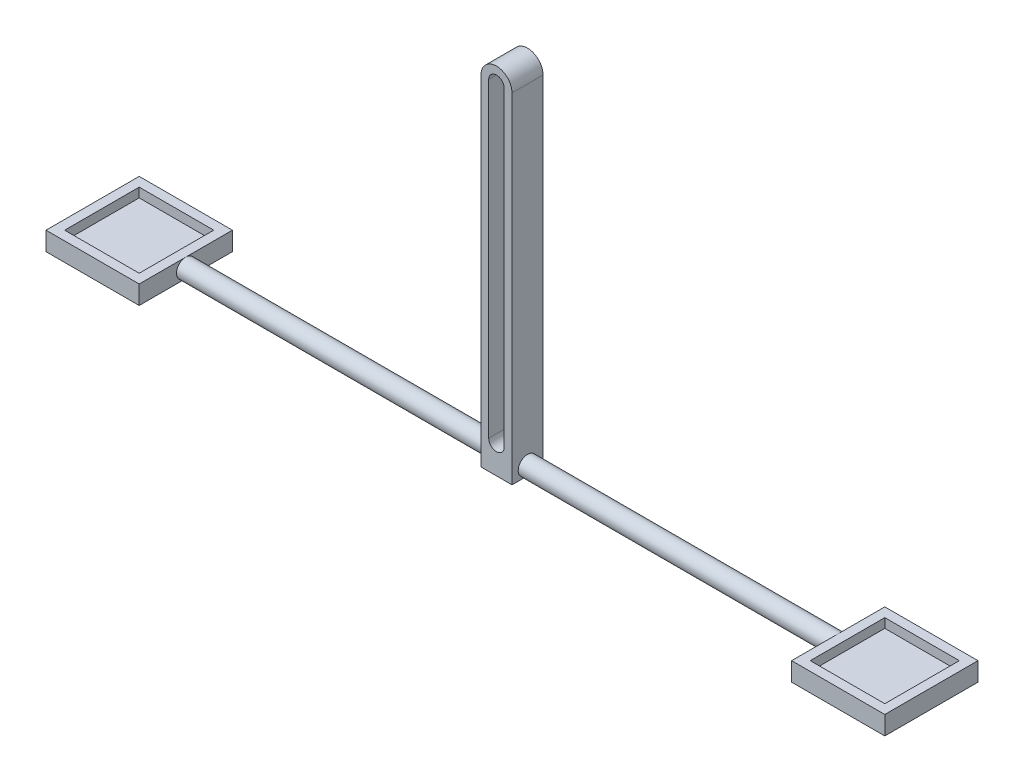
ISO-10303-21;
HEADER;
FILE_DESCRIPTION(('STEP AP214'),'2;1');
FILE_NAME('part.step','',(''),(''),'','','');
FILE_SCHEMA(('AUTOMOTIVE_DESIGN { 1 0 10303 214 1 1 1 1 }'));
ENDSEC;
DATA;
#1=APPLICATION_CONTEXT('core data for automotive mechanical design processes');
#2=APPLICATION_PROTOCOL_DEFINITION('international standard','automotive_design',2000,#1);
#3=PRODUCT_CONTEXT('',#1,'mechanical');
#4=PRODUCT('Part','Part','',(#3));
#5=PRODUCT_RELATED_PRODUCT_CATEGORY('part','',(#4));
#6=PRODUCT_DEFINITION_FORMATION('','',#4);
#7=PRODUCT_DEFINITION_CONTEXT('part definition',#1,'design');
#8=PRODUCT_DEFINITION('design','',#6,#7);
#9=PRODUCT_DEFINITION_SHAPE('','',#8);
#10=(LENGTH_UNIT() NAMED_UNIT(*) SI_UNIT(.MILLI.,.METRE.));
#11=(NAMED_UNIT(*) PLANE_ANGLE_UNIT() SI_UNIT($,.RADIAN.));
#12=(NAMED_UNIT(*) SI_UNIT($,.STERADIAN.) SOLID_ANGLE_UNIT());
#13=UNCERTAINTY_MEASURE_WITH_UNIT(LENGTH_MEASURE(1.E-05),#10,'distance_accuracy_value','');
#14=(GEOMETRIC_REPRESENTATION_CONTEXT(3) GLOBAL_UNCERTAINTY_ASSIGNED_CONTEXT((#13)) GLOBAL_UNIT_ASSIGNED_CONTEXT((#10,
#11,#12)) REPRESENTATION_CONTEXT('',''));
#15=CARTESIAN_POINT('',(0.,0.,0.));
#16=DIRECTION('',(0.,0.,1.));
#17=DIRECTION('',(1.,0.,0.));
#18=AXIS2_PLACEMENT_3D('',#15,#16,#17);
#19=CARTESIAN_POINT('',(0.,100.,10.));
#20=DIRECTION('',(0.,0.,1.));
#21=DIRECTION('',(1.,0.,0.));
#22=AXIS2_PLACEMENT_3D('',#19,#20,#21);
#23=PLANE('',#22);
#24=DIRECTION('',(-1.,0.,0.));
#25=VECTOR('',#24,1.);
#26=CARTESIAN_POINT('',(-4.99999999999997,-9.25,10.));
#27=LINE('',#26,#25);
#28=CARTESIAN_POINT('',(5.,-9.25,10.));
#29=VERTEX_POINT('',#28);
#30=CARTESIAN_POINT('',(-4.99999999999997,-9.25,10.));
#31=VERTEX_POINT('',#30);
#32=EDGE_CURVE('E226',#29,#31,#27,.T.);
#33=ORIENTED_EDGE('',*,*,#32,.F.);
#34=DIRECTION('',(0.,1.,0.));
#35=VECTOR('',#34,1.);
#36=CARTESIAN_POINT('',(5.,-10.,10.));
#37=LINE('',#36,#35);
#38=CARTESIAN_POINT('',(5.,100.,10.));
#39=VERTEX_POINT('',#38);
#40=EDGE_CURVE('E238',#29,#39,#37,.T.);
#41=ORIENTED_EDGE('',*,*,#40,.T.);
#42=CARTESIAN_POINT('',(0.,100.,10.));
#43=DIRECTION('',(0.,0.,1.));
#44=DIRECTION('',(1.,0.,0.));
#45=AXIS2_PLACEMENT_3D('',#42,#43,#44);
#46=CIRCLE('',#45,5.);
#47=CARTESIAN_POINT('',(-5.,100.,10.));
#48=VERTEX_POINT('',#47);
#49=EDGE_CURVE('E251',#39,#48,#46,.T.);
#50=ORIENTED_EDGE('',*,*,#49,.T.);
#51=DIRECTION('',(0.,-1.,0.));
#52=VECTOR('',#51,1.);
#53=CARTESIAN_POINT('',(-5.,100.,10.));
#54=LINE('',#53,#52);
#55=EDGE_CURVE('E240',#48,#31,#54,.T.);
#56=ORIENTED_EDGE('',*,*,#55,.T.);
#57=EDGE_LOOP('',(#33,#41,#50,#56));
#58=FACE_BOUND('',#57,.T.);
#59=DIRECTION('',(0.,1.,0.));
#60=VECTOR('',#59,1.);
#61=CARTESIAN_POINT('',(2.5,0.,10.));
#62=LINE('',#61,#60);
#63=CARTESIAN_POINT('',(2.5,0.,10.));
#64=VERTEX_POINT('',#63);
#65=CARTESIAN_POINT('',(2.5,100.,10.));
#66=VERTEX_POINT('',#65);
#67=EDGE_CURVE('E308',#64,#66,#62,.T.);
#68=ORIENTED_EDGE('',*,*,#67,.F.);
#69=CARTESIAN_POINT('',(0.,0.,10.));
#70=DIRECTION('',(0.,0.,1.));
#71=DIRECTION('',(1.,0.,0.));
#72=AXIS2_PLACEMENT_3D('',#69,#70,#71);
#73=CIRCLE('',#72,2.5);
#74=CARTESIAN_POINT('',(-2.5,0.,10.));
#75=VERTEX_POINT('',#74);
#76=EDGE_CURVE('E288',#75,#64,#73,.T.);
#77=ORIENTED_EDGE('',*,*,#76,.F.);
#78=DIRECTION('',(0.,-1.,0.));
#79=VECTOR('',#78,1.);
#80=CARTESIAN_POINT('',(-2.5,0.,10.));
#81=LINE('',#80,#79);
#82=CARTESIAN_POINT('',(-2.5,100.,10.));
#83=VERTEX_POINT('',#82);
#84=EDGE_CURVE('E283',#83,#75,#81,.T.);
#85=ORIENTED_EDGE('',*,*,#84,.F.);
#86=CARTESIAN_POINT('',(0.,100.,10.));
#87=DIRECTION('',(0.,0.,1.));
#88=DIRECTION('',(1.,0.,0.));
#89=AXIS2_PLACEMENT_3D('',#86,#87,#88);
#90=CIRCLE('',#89,2.5);
#91=EDGE_CURVE('E304',#66,#83,#90,.T.);
#92=ORIENTED_EDGE('',*,*,#91,.F.);
#93=EDGE_LOOP('',(#68,#77,#85,#92));
#94=FACE_BOUND('',#93,.T.);
#95=ADVANCED_FACE('F44',(#58,#94),#23,.T.);
#96=CARTESIAN_POINT('',(0.,100.,0.));
#97=DIRECTION('',(0.,0.,1.));
#98=DIRECTION('',(1.,0.,0.));
#99=AXIS2_PLACEMENT_3D('',#96,#97,#98);
#100=PLANE('',#99);
#101=DIRECTION('',(0.,1.,0.));
#102=VECTOR('',#101,1.);
#103=CARTESIAN_POINT('',(5.,100.,0.));
#104=LINE('',#103,#102);
#105=CARTESIAN_POINT('',(5.00000000000001,-9.25000000000001,0.));
#106=VERTEX_POINT('',#105);
#107=CARTESIAN_POINT('',(5.,100.,0.));
#108=VERTEX_POINT('',#107);
#109=EDGE_CURVE('E264',#106,#108,#104,.T.);
#110=ORIENTED_EDGE('',*,*,#109,.F.);
#111=DIRECTION('',(1.,0.,0.));
#112=VECTOR('',#111,1.);
#113=CARTESIAN_POINT('',(-4.99999999999997,-9.25,0.));
#114=LINE('',#113,#112);
#115=CARTESIAN_POINT('',(-4.99999999999997,-9.25,0.));
#116=VERTEX_POINT('',#115);
#117=EDGE_CURVE('E61',#116,#106,#114,.T.);
#118=ORIENTED_EDGE('',*,*,#117,.F.);
#119=DIRECTION('',(0.,-1.,0.));
#120=VECTOR('',#119,1.);
#121=CARTESIAN_POINT('',(-4.99999999999999,0.,0.));
#122=LINE('',#121,#120);
#123=CARTESIAN_POINT('',(-5.,100.,0.));
#124=VERTEX_POINT('',#123);
#125=EDGE_CURVE('E259',#124,#116,#122,.T.);
#126=ORIENTED_EDGE('',*,*,#125,.F.);
#127=CARTESIAN_POINT('',(0.,100.,0.));
#128=DIRECTION('',(0.,0.,1.));
#129=DIRECTION('',(1.,0.,0.));
#130=AXIS2_PLACEMENT_3D('',#127,#128,#129);
#131=CIRCLE('',#130,5.);
#132=EDGE_CURVE('E255',#108,#124,#131,.T.);
#133=ORIENTED_EDGE('',*,*,#132,.F.);
#134=EDGE_LOOP('',(#110,#118,#126,#133));
#135=FACE_BOUND('',#134,.T.);
#136=CARTESIAN_POINT('',(0.,0.,0.));
#137=DIRECTION('',(0.,0.,1.));
#138=DIRECTION('',(1.,0.,0.));
#139=AXIS2_PLACEMENT_3D('',#136,#137,#138);
#140=CIRCLE('',#139,2.5);
#141=CARTESIAN_POINT('',(-2.5,0.,0.));
#142=VERTEX_POINT('',#141);
#143=CARTESIAN_POINT('',(2.5,0.,0.));
#144=VERTEX_POINT('',#143);
#145=EDGE_CURVE('E297',#142,#144,#140,.T.);
#146=ORIENTED_EDGE('',*,*,#145,.T.);
#147=DIRECTION('',(0.,1.,0.));
#148=VECTOR('',#147,1.);
#149=CARTESIAN_POINT('',(2.5,0.,0.));
#150=LINE('',#149,#148);
#151=CARTESIAN_POINT('',(2.5,100.,0.));
#152=VERTEX_POINT('',#151);
#153=EDGE_CURVE('E293',#144,#152,#150,.T.);
#154=ORIENTED_EDGE('',*,*,#153,.T.);
#155=CARTESIAN_POINT('',(0.,100.,0.));
#156=DIRECTION('',(0.,0.,1.));
#157=DIRECTION('',(1.,0.,0.));
#158=AXIS2_PLACEMENT_3D('',#155,#156,#157);
#159=CIRCLE('',#158,2.5);
#160=CARTESIAN_POINT('',(-2.5,100.,0.));
#161=VERTEX_POINT('',#160);
#162=EDGE_CURVE('E289',#152,#161,#159,.T.);
#163=ORIENTED_EDGE('',*,*,#162,.T.);
#164=DIRECTION('',(0.,-1.,0.));
#165=VECTOR('',#164,1.);
#166=CARTESIAN_POINT('',(-2.5,0.,0.));
#167=LINE('',#166,#165);
#168=EDGE_CURVE('E284',#161,#142,#167,.T.);
#169=ORIENTED_EDGE('',*,*,#168,.T.);
#170=EDGE_LOOP('',(#146,#154,#163,#169));
#171=FACE_BOUND('',#170,.T.);
#172=ADVANCED_FACE('F538',(#135,#171),#100,.F.);
#173=CARTESIAN_POINT('',(0.,100.,10.));
#174=DIRECTION('',(0.,0.,-1.));
#175=DIRECTION('',(-1.,0.,0.));
#176=AXIS2_PLACEMENT_3D('',#173,#174,#175);
#177=CYLINDRICAL_SURFACE('',#176,5.);
#178=ORIENTED_EDGE('',*,*,#132,.T.);
#179=DIRECTION('',(0.,0.,-1.));
#180=VECTOR('',#179,1.);
#181=CARTESIAN_POINT('',(-5.,100.,10.));
#182=LINE('',#181,#180);
#183=EDGE_CURVE('E11',#48,#124,#182,.T.);
#184=ORIENTED_EDGE('',*,*,#183,.F.);
#185=ORIENTED_EDGE('',*,*,#49,.F.);
#186=DIRECTION('',(0.,0.,-1.));
#187=VECTOR('',#186,1.);
#188=CARTESIAN_POINT('',(5.,100.,10.));
#189=LINE('',#188,#187);
#190=EDGE_CURVE('E54',#39,#108,#189,.T.);
#191=ORIENTED_EDGE('',*,*,#190,.T.);
#192=EDGE_LOOP('',(#178,#184,#185,#191));
#193=FACE_BOUND('',#192,.T.);
#194=ADVANCED_FACE('F46',(#193),#177,.T.);
#195=CARTESIAN_POINT('',(-4.99999999999999,0.,10.));
#196=DIRECTION('',(1.,0.,0.));
#197=DIRECTION('',(0.,1.,0.));
#198=AXIS2_PLACEMENT_3D('',#195,#196,#197);
#199=PLANE('',#198);
#200=ORIENTED_EDGE('',*,*,#125,.T.);
#201=DIRECTION('',(0.,0.,1.));
#202=VECTOR('',#201,1.);
#203=CARTESIAN_POINT('',(-4.99999999999997,-9.25,-10.001));
#204=LINE('',#203,#202);
#205=CARTESIAN_POINT('',(-4.99999999999998,-9.25,5.));
#206=VERTEX_POINT('',#205);
#207=EDGE_CURVE('E489',#116,#206,#204,.T.);
#208=ORIENTED_EDGE('',*,*,#207,.T.);
#209=CARTESIAN_POINT('',(-4.99999999999998,-6.25,5.));
#210=DIRECTION('',(1.,0.,0.));
#211=DIRECTION('',(0.,1.,0.));
#212=AXIS2_PLACEMENT_3D('',#209,#210,#211);
#213=CIRCLE('',#212,3.);
#214=EDGE_CURVE('E301',#206,#206,#213,.T.);
#215=ORIENTED_EDGE('',*,*,#214,.T.);
#216=EDGE_CURVE('E502',#206,#31,#204,.T.);
#217=ORIENTED_EDGE('',*,*,#216,.T.);
#218=ORIENTED_EDGE('',*,*,#55,.F.);
#219=ORIENTED_EDGE('',*,*,#183,.T.);
#220=EDGE_LOOP('',(#200,#208,#215,#217,#218,#219));
#221=FACE_BOUND('',#220,.T.);
#222=ADVANCED_FACE('F550',(#221),#199,.F.);
#223=CARTESIAN_POINT('',(5.,100.,10.));
#224=DIRECTION('',(-1.,0.,0.));
#225=DIRECTION('',(0.,-1.,0.));
#226=AXIS2_PLACEMENT_3D('',#223,#224,#225);
#227=PLANE('',#226);
#228=ORIENTED_EDGE('',*,*,#40,.F.);
#229=DIRECTION('',(0.,0.,1.));
#230=VECTOR('',#229,1.);
#231=CARTESIAN_POINT('',(5.,-9.25,-10.001));
#232=LINE('',#231,#230);
#233=CARTESIAN_POINT('',(5.,-9.25,5.));
#234=VERTEX_POINT('',#233);
#235=EDGE_CURVE('E223',#234,#29,#232,.T.);
#236=ORIENTED_EDGE('',*,*,#235,.F.);
#237=CARTESIAN_POINT('',(5.00000000000002,-6.25,5.));
#238=DIRECTION('',(-1.,0.,0.));
#239=DIRECTION('',(0.,-1.,0.));
#240=AXIS2_PLACEMENT_3D('',#237,#238,#239);
#241=CIRCLE('',#240,3.);
#242=EDGE_CURVE('E48',#234,#234,#241,.T.);
#243=ORIENTED_EDGE('',*,*,#242,.T.);
#244=EDGE_CURVE('E228',#106,#234,#232,.T.);
#245=ORIENTED_EDGE('',*,*,#244,.F.);
#246=ORIENTED_EDGE('',*,*,#109,.T.);
#247=ORIENTED_EDGE('',*,*,#190,.F.);
#248=EDGE_LOOP('',(#228,#236,#243,#245,#246,#247));
#249=FACE_BOUND('',#248,.T.);
#250=ADVANCED_FACE('F243',(#249),#227,.F.);
#251=CARTESIAN_POINT('',(0.,0.,10.));
#252=DIRECTION('',(0.,0.,-1.));
#253=DIRECTION('',(-1.,0.,0.));
#254=AXIS2_PLACEMENT_3D('',#251,#252,#253);
#255=CYLINDRICAL_SURFACE('',#254,2.5);
#256=ORIENTED_EDGE('',*,*,#145,.F.);
#257=DIRECTION('',(0.,0.,-1.));
#258=VECTOR('',#257,1.);
#259=CARTESIAN_POINT('',(-2.5,0.,10.));
#260=LINE('',#259,#258);
#261=EDGE_CURVE('E279',#75,#142,#260,.T.);
#262=ORIENTED_EDGE('',*,*,#261,.F.);
#263=ORIENTED_EDGE('',*,*,#76,.T.);
#264=DIRECTION('',(0.,0.,-1.));
#265=VECTOR('',#264,1.);
#266=CARTESIAN_POINT('',(2.5,0.,10.));
#267=LINE('',#266,#265);
#268=EDGE_CURVE('E260',#64,#144,#267,.T.);
#269=ORIENTED_EDGE('',*,*,#268,.T.);
#270=EDGE_LOOP('',(#256,#262,#263,#269));
#271=FACE_BOUND('',#270,.T.);
#272=ADVANCED_FACE('F547',(#271),#255,.F.);
#273=CARTESIAN_POINT('',(2.5,0.,10.));
#274=DIRECTION('',(-1.,0.,0.));
#275=DIRECTION('',(0.,0.,1.));
#276=AXIS2_PLACEMENT_3D('',#273,#274,#275);
#277=PLANE('',#276);
#278=ORIENTED_EDGE('',*,*,#153,.F.);
#279=ORIENTED_EDGE('',*,*,#268,.F.);
#280=ORIENTED_EDGE('',*,*,#67,.T.);
#281=DIRECTION('',(0.,0.,-1.));
#282=VECTOR('',#281,1.);
#283=CARTESIAN_POINT('',(2.5,100.,10.));
#284=LINE('',#283,#282);
#285=EDGE_CURVE('E273',#66,#152,#284,.T.);
#286=ORIENTED_EDGE('',*,*,#285,.T.);
#287=EDGE_LOOP('',(#278,#279,#280,#286));
#288=FACE_BOUND('',#287,.T.);
#289=ADVANCED_FACE('F568',(#288),#277,.T.);
#290=CARTESIAN_POINT('',(0.,100.,10.));
#291=DIRECTION('',(0.,0.,-1.));
#292=DIRECTION('',(-1.,0.,0.));
#293=AXIS2_PLACEMENT_3D('',#290,#291,#292);
#294=CYLINDRICAL_SURFACE('',#293,2.5);
#295=ORIENTED_EDGE('',*,*,#162,.F.);
#296=ORIENTED_EDGE('',*,*,#285,.F.);
#297=ORIENTED_EDGE('',*,*,#91,.T.);
#298=DIRECTION('',(0.,0.,-1.));
#299=VECTOR('',#298,1.);
#300=CARTESIAN_POINT('',(-2.5,100.,10.));
#301=LINE('',#300,#299);
#302=EDGE_CURVE('E276',#83,#161,#301,.T.);
#303=ORIENTED_EDGE('',*,*,#302,.T.);
#304=EDGE_LOOP('',(#295,#296,#297,#303));
#305=FACE_BOUND('',#304,.T.);
#306=ADVANCED_FACE('F533',(#305),#294,.F.);
#307=CARTESIAN_POINT('',(-2.5,0.,10.));
#308=DIRECTION('',(1.,0.,0.));
#309=DIRECTION('',(0.,0.,-1.));
#310=AXIS2_PLACEMENT_3D('',#307,#308,#309);
#311=PLANE('',#310);
#312=ORIENTED_EDGE('',*,*,#168,.F.);
#313=ORIENTED_EDGE('',*,*,#302,.F.);
#314=ORIENTED_EDGE('',*,*,#84,.T.);
#315=ORIENTED_EDGE('',*,*,#261,.T.);
#316=EDGE_LOOP('',(#312,#313,#314,#315));
#317=FACE_BOUND('',#316,.T.);
#318=ADVANCED_FACE('F523',(#317),#311,.T.);
#319=CARTESIAN_POINT('',(-105.,-6.25000000000001,5.));
#320=DIRECTION('',(1.,0.,0.));
#321=DIRECTION('',(0.,1.,0.));
#322=AXIS2_PLACEMENT_3D('',#319,#320,#321);
#323=CYLINDRICAL_SURFACE('',#322,3.);
#324=CARTESIAN_POINT('',(105.,-6.24999999999999,5.));
#325=DIRECTION('',(1.,0.,0.));
#326=DIRECTION('',(0.,1.,0.));
#327=AXIS2_PLACEMENT_3D('',#324,#325,#326);
#328=CIRCLE('',#327,3.);
#329=CARTESIAN_POINT('',(105.,-3.24999999999999,5.));
#330=VERTEX_POINT('',#329);
#331=CARTESIAN_POINT('',(105.,-9.24999999999999,5.));
#332=VERTEX_POINT('',#331);
#333=EDGE_CURVE('E321',#330,#332,#328,.T.);
#334=ORIENTED_EDGE('',*,*,#333,.F.);
#335=EDGE_CURVE('E324',#332,#330,#328,.T.);
#336=ORIENTED_EDGE('',*,*,#335,.F.);
#337=EDGE_LOOP('',(#334,#336));
#338=FACE_BOUND('',#337,.T.);
#339=ORIENTED_EDGE('',*,*,#242,.F.);
#340=EDGE_LOOP('',(#339));
#341=FACE_BOUND('',#340,.T.);
#342=ADVANCED_FACE('F520',(#338,#341),#323,.T.);
#343=CARTESIAN_POINT('',(-105.,-6.25000000000001,5.));
#344=DIRECTION('',(1.,0.,0.));
#345=DIRECTION('',(0.,1.,0.));
#346=AXIS2_PLACEMENT_3D('',#343,#344,#345);
#347=CIRCLE('',#346,3.);
#348=CARTESIAN_POINT('',(-105.,-3.25000000000001,5.));
#349=VERTEX_POINT('',#348);
#350=CARTESIAN_POINT('',(-105.,-9.25000000000001,5.));
#351=VERTEX_POINT('',#350);
#352=EDGE_CURVE('E316',#349,#351,#347,.T.);
#353=ORIENTED_EDGE('',*,*,#352,.T.);
#354=EDGE_CURVE('E320',#351,#349,#347,.T.);
#355=ORIENTED_EDGE('',*,*,#354,.T.);
#356=EDGE_LOOP('',(#353,#355));
#357=FACE_BOUND('',#356,.T.);
#358=ORIENTED_EDGE('',*,*,#214,.F.);
#359=EDGE_LOOP('',(#358));
#360=FACE_BOUND('',#359,.T.);
#361=ADVANCED_FACE('F522',(#357,#360),#323,.T.);
#362=CARTESIAN_POINT('',(105.,-6.24999999999999,8.));
#363=DIRECTION('',(-1.,0.,0.));
#364=DIRECTION('',(0.,-1.,0.));
#365=AXIS2_PLACEMENT_3D('',#362,#363,#364);
#366=PLANE('',#365);
#367=DIRECTION('',(0.,-1.,0.));
#368=VECTOR('',#367,1.);
#369=CARTESIAN_POINT('',(105.,-6.24999999999999,20.));
#370=LINE('',#369,#368);
#371=CARTESIAN_POINT('',(105.,-3.24999999999999,20.));
#372=VERTEX_POINT('',#371);
#373=CARTESIAN_POINT('',(105.,-9.24999999999999,20.));
#374=VERTEX_POINT('',#373);
#375=EDGE_CURVE('E336',#372,#374,#370,.T.);
#376=ORIENTED_EDGE('',*,*,#375,.F.);
#377=DIRECTION('',(0.,0.,1.));
#378=VECTOR('',#377,1.);
#379=CARTESIAN_POINT('',(105.,-3.24999999999999,-10.));
#380=LINE('',#379,#378);
#381=EDGE_CURVE('E451',#330,#372,#380,.T.);
#382=ORIENTED_EDGE('',*,*,#381,.F.);
#383=ORIENTED_EDGE('',*,*,#333,.T.);
#384=DIRECTION('',(0.,0.,-1.));
#385=VECTOR('',#384,1.);
#386=CARTESIAN_POINT('',(105.,-9.24999999999999,8.));
#387=LINE('',#386,#385);
#388=EDGE_CURVE('E330',#374,#332,#387,.T.);
#389=ORIENTED_EDGE('',*,*,#388,.F.);
#390=EDGE_LOOP('',(#376,#382,#383,#389));
#391=FACE_BOUND('',#390,.T.);
#392=ADVANCED_FACE('F530',(#391),#366,.T.);
#393=CARTESIAN_POINT('',(105.,-9.24999999999999,-10.));
#394=VERTEX_POINT('',#393);
#395=EDGE_CURVE('E342',#332,#394,#387,.T.);
#396=ORIENTED_EDGE('',*,*,#395,.F.);
#397=ORIENTED_EDGE('',*,*,#335,.T.);
#398=CARTESIAN_POINT('',(105.,-3.24999999999999,-10.));
#399=VERTEX_POINT('',#398);
#400=EDGE_CURVE('E447',#399,#330,#380,.T.);
#401=ORIENTED_EDGE('',*,*,#400,.F.);
#402=DIRECTION('',(0.,-1.,0.));
#403=VECTOR('',#402,1.);
#404=CARTESIAN_POINT('',(105.,-6.24999999999999,-10.));
#405=LINE('',#404,#403);
#406=EDGE_CURVE('E325',#399,#394,#405,.T.);
#407=ORIENTED_EDGE('',*,*,#406,.T.);
#408=EDGE_LOOP('',(#396,#397,#401,#407));
#409=FACE_BOUND('',#408,.T.);
#410=ADVANCED_FACE('F639',(#409),#366,.T.);
#411=CARTESIAN_POINT('',(105.,-6.24999999999999,20.));
#412=DIRECTION('',(0.,0.,1.));
#413=DIRECTION('',(1.,0.,0.));
#414=AXIS2_PLACEMENT_3D('',#411,#412,#413);
#415=PLANE('',#414);
#416=DIRECTION('',(-1.,0.,0.));
#417=VECTOR('',#416,1.);
#418=CARTESIAN_POINT('',(105.,-9.24999999999999,20.));
#419=LINE('',#418,#417);
#420=CARTESIAN_POINT('',(135.,-9.24999999999999,20.));
#421=VERTEX_POINT('',#420);
#422=EDGE_CURVE('E343',#421,#374,#419,.T.);
#423=ORIENTED_EDGE('',*,*,#422,.F.);
#424=DIRECTION('',(0.,-1.,0.));
#425=VECTOR('',#424,1.);
#426=CARTESIAN_POINT('',(135.,-6.24999999999999,20.));
#427=LINE('',#426,#425);
#428=CARTESIAN_POINT('',(135.,-3.24999999999999,20.));
#429=VERTEX_POINT('',#428);
#430=EDGE_CURVE('E333',#429,#421,#427,.T.);
#431=ORIENTED_EDGE('',*,*,#430,.F.);
#432=DIRECTION('',(1.,0.,0.));
#433=VECTOR('',#432,1.);
#434=CARTESIAN_POINT('',(105.,-3.24999999999999,20.));
#435=LINE('',#434,#433);
#436=EDGE_CURVE('E432',#372,#429,#435,.T.);
#437=ORIENTED_EDGE('',*,*,#436,.F.);
#438=ORIENTED_EDGE('',*,*,#375,.T.);
#439=EDGE_LOOP('',(#423,#431,#437,#438));
#440=FACE_BOUND('',#439,.T.);
#441=ADVANCED_FACE('F649',(#440),#415,.T.);
#442=CARTESIAN_POINT('',(135.,-6.24999999999999,-9.99999999999999));
#443=DIRECTION('',(1.,0.,0.));
#444=DIRECTION('',(0.,1.,0.));
#445=AXIS2_PLACEMENT_3D('',#442,#443,#444);
#446=PLANE('',#445);
#447=DIRECTION('',(0.,0.,1.));
#448=VECTOR('',#447,1.);
#449=CARTESIAN_POINT('',(135.,-9.24999999999999,-9.99999999999999));
#450=LINE('',#449,#448);
#451=CARTESIAN_POINT('',(135.,-9.24999999999999,-9.99999999999999));
#452=VERTEX_POINT('',#451);
#453=EDGE_CURVE('E347',#452,#421,#450,.T.);
#454=ORIENTED_EDGE('',*,*,#453,.F.);
#455=DIRECTION('',(0.,-1.,0.));
#456=VECTOR('',#455,1.);
#457=CARTESIAN_POINT('',(135.,-6.24999999999999,-9.99999999999999));
#458=LINE('',#457,#456);
#459=CARTESIAN_POINT('',(135.,-3.24999999999999,-10.));
#460=VERTEX_POINT('',#459);
#461=EDGE_CURVE('E329',#460,#452,#458,.T.);
#462=ORIENTED_EDGE('',*,*,#461,.F.);
#463=DIRECTION('',(0.,0.,-1.));
#464=VECTOR('',#463,1.);
#465=CARTESIAN_POINT('',(135.,-3.24999999999999,8.));
#466=LINE('',#465,#464);
#467=EDGE_CURVE('E456',#429,#460,#466,.T.);
#468=ORIENTED_EDGE('',*,*,#467,.F.);
#469=ORIENTED_EDGE('',*,*,#430,.T.);
#470=EDGE_LOOP('',(#454,#462,#468,#469));
#471=FACE_BOUND('',#470,.T.);
#472=ADVANCED_FACE('F659',(#471),#446,.T.);
#473=CARTESIAN_POINT('',(105.,-6.24999999999999,-10.));
#474=DIRECTION('',(0.,0.,-1.));
#475=DIRECTION('',(-1.,0.,0.));
#476=AXIS2_PLACEMENT_3D('',#473,#474,#475);
#477=PLANE('',#476);
#478=DIRECTION('',(1.,0.,0.));
#479=VECTOR('',#478,1.);
#480=CARTESIAN_POINT('',(105.,-9.24999999999999,-10.));
#481=LINE('',#480,#479);
#482=EDGE_CURVE('E351',#394,#452,#481,.T.);
#483=ORIENTED_EDGE('',*,*,#482,.F.);
#484=ORIENTED_EDGE('',*,*,#406,.F.);
#485=DIRECTION('',(-1.,0.,0.));
#486=VECTOR('',#485,1.);
#487=CARTESIAN_POINT('',(135.,-3.24999999999999,-10.));
#488=LINE('',#487,#486);
#489=EDGE_CURVE('E452',#460,#399,#488,.T.);
#490=ORIENTED_EDGE('',*,*,#489,.F.);
#491=ORIENTED_EDGE('',*,*,#461,.T.);
#492=EDGE_LOOP('',(#483,#484,#490,#491));
#493=FACE_BOUND('',#492,.T.);
#494=ADVANCED_FACE('F670',(#493),#477,.T.);
#495=CARTESIAN_POINT('',(0.,-9.25,0.));
#496=DIRECTION('',(0.,1.,0.));
#497=DIRECTION('',(-1.,0.,0.));
#498=AXIS2_PLACEMENT_3D('',#495,#496,#497);
#499=PLANE('',#498);
#500=ORIENTED_EDGE('',*,*,#388,.T.);
#501=ORIENTED_EDGE('',*,*,#395,.T.);
#502=ORIENTED_EDGE('',*,*,#482,.T.);
#503=ORIENTED_EDGE('',*,*,#453,.T.);
#504=ORIENTED_EDGE('',*,*,#422,.T.);
#505=EDGE_LOOP('',(#500,#501,#502,#503,#504));
#506=FACE_BOUND('',#505,.T.);
#507=ADVANCED_FACE('F680',(#506),#499,.F.);
#508=CARTESIAN_POINT('',(-105.,-6.25000000000001,2.));
#509=DIRECTION('',(1.,0.,0.));
#510=DIRECTION('',(0.,1.,0.));
#511=AXIS2_PLACEMENT_3D('',#508,#509,#510);
#512=PLANE('',#511);
#513=ORIENTED_EDGE('',*,*,#352,.F.);
#514=DIRECTION('',(0.,0.,-1.));
#515=VECTOR('',#514,1.);
#516=CARTESIAN_POINT('',(-105.,-3.25000000000001,8.));
#517=LINE('',#516,#515);
#518=CARTESIAN_POINT('',(-105.,-3.25000000000001,20.));
#519=VERTEX_POINT('',#518);
#520=EDGE_CURVE('E397',#519,#349,#517,.T.);
#521=ORIENTED_EDGE('',*,*,#520,.F.);
#522=DIRECTION('',(0.,-1.,0.));
#523=VECTOR('',#522,1.);
#524=CARTESIAN_POINT('',(-105.,-6.25000000000001,20.));
#525=LINE('',#524,#523);
#526=CARTESIAN_POINT('',(-105.,-9.25000000000001,20.));
#527=VERTEX_POINT('',#526);
#528=EDGE_CURVE('E382',#519,#527,#525,.T.);
#529=ORIENTED_EDGE('',*,*,#528,.T.);
#530=DIRECTION('',(0.,0.,1.));
#531=VECTOR('',#530,1.);
#532=CARTESIAN_POINT('',(-105.,-9.25000000000001,2.));
#533=LINE('',#532,#531);
#534=EDGE_CURVE('E371',#351,#527,#533,.T.);
#535=ORIENTED_EDGE('',*,*,#534,.F.);
#536=EDGE_LOOP('',(#513,#521,#529,#535));
#537=FACE_BOUND('',#536,.T.);
#538=ADVANCED_FACE('F697',(#537),#512,.T.);
#539=ORIENTED_EDGE('',*,*,#354,.F.);
#540=CARTESIAN_POINT('',(-105.,-9.25000000000001,-10.));
#541=VERTEX_POINT('',#540);
#542=EDGE_CURVE('E367',#541,#351,#533,.T.);
#543=ORIENTED_EDGE('',*,*,#542,.F.);
#544=DIRECTION('',(0.,-1.,0.));
#545=VECTOR('',#544,1.);
#546=CARTESIAN_POINT('',(-105.,-6.25000000000001,-10.));
#547=LINE('',#546,#545);
#548=CARTESIAN_POINT('',(-105.,-3.25000000000001,-10.));
#549=VERTEX_POINT('',#548);
#550=EDGE_CURVE('E372',#549,#541,#547,.T.);
#551=ORIENTED_EDGE('',*,*,#550,.F.);
#552=EDGE_CURVE('E401',#349,#549,#517,.T.);
#553=ORIENTED_EDGE('',*,*,#552,.F.);
#554=EDGE_LOOP('',(#539,#543,#551,#553));
#555=FACE_BOUND('',#554,.T.);
#556=ADVANCED_FACE('F706',(#555),#512,.T.);
#557=CARTESIAN_POINT('',(-105.,-6.25000000000001,-10.));
#558=DIRECTION('',(0.,0.,-1.));
#559=DIRECTION('',(-1.,0.,0.));
#560=AXIS2_PLACEMENT_3D('',#557,#558,#559);
#561=PLANE('',#560);
#562=DIRECTION('',(1.,0.,0.));
#563=VECTOR('',#562,1.);
#564=CARTESIAN_POINT('',(-105.,-9.25000000000001,-10.));
#565=LINE('',#564,#563);
#566=CARTESIAN_POINT('',(-135.,-9.25000000000002,-10.));
#567=VERTEX_POINT('',#566);
#568=EDGE_CURVE('E363',#567,#541,#565,.T.);
#569=ORIENTED_EDGE('',*,*,#568,.F.);
#570=DIRECTION('',(0.,-1.,0.));
#571=VECTOR('',#570,1.);
#572=CARTESIAN_POINT('',(-135.,-6.25000000000002,-10.));
#573=LINE('',#572,#571);
#574=CARTESIAN_POINT('',(-135.,-3.25000000000002,-10.));
#575=VERTEX_POINT('',#574);
#576=EDGE_CURVE('E375',#575,#567,#573,.T.);
#577=ORIENTED_EDGE('',*,*,#576,.F.);
#578=DIRECTION('',(-1.,0.,0.));
#579=VECTOR('',#578,1.);
#580=CARTESIAN_POINT('',(-105.,-3.25000000000001,-10.));
#581=LINE('',#580,#579);
#582=EDGE_CURVE('E393',#549,#575,#581,.T.);
#583=ORIENTED_EDGE('',*,*,#582,.F.);
#584=ORIENTED_EDGE('',*,*,#550,.T.);
#585=EDGE_LOOP('',(#569,#577,#583,#584));
#586=FACE_BOUND('',#585,.T.);
#587=ADVANCED_FACE('F716',(#586),#561,.T.);
#588=CARTESIAN_POINT('',(-135.,-6.25000000000002,-10.));
#589=DIRECTION('',(-1.,0.,0.));
#590=DIRECTION('',(0.,-1.,0.));
#591=AXIS2_PLACEMENT_3D('',#588,#589,#590);
#592=PLANE('',#591);
#593=DIRECTION('',(0.,0.,-1.));
#594=VECTOR('',#593,1.);
#595=CARTESIAN_POINT('',(-135.,-9.25000000000002,-10.));
#596=LINE('',#595,#594);
#597=CARTESIAN_POINT('',(-135.,-9.25000000000002,20.));
#598=VERTEX_POINT('',#597);
#599=EDGE_CURVE('E359',#598,#567,#596,.T.);
#600=ORIENTED_EDGE('',*,*,#599,.F.);
#601=DIRECTION('',(0.,-1.,0.));
#602=VECTOR('',#601,1.);
#603=CARTESIAN_POINT('',(-135.,-6.25000000000002,20.));
#604=LINE('',#603,#602);
#605=CARTESIAN_POINT('',(-135.,-3.25000000000002,20.));
#606=VERTEX_POINT('',#605);
#607=EDGE_CURVE('E379',#606,#598,#604,.T.);
#608=ORIENTED_EDGE('',*,*,#607,.F.);
#609=DIRECTION('',(0.,0.,1.));
#610=VECTOR('',#609,1.);
#611=CARTESIAN_POINT('',(-135.,-3.25000000000002,-10.));
#612=LINE('',#611,#610);
#613=EDGE_CURVE('E389',#575,#606,#612,.T.);
#614=ORIENTED_EDGE('',*,*,#613,.F.);
#615=ORIENTED_EDGE('',*,*,#576,.T.);
#616=EDGE_LOOP('',(#600,#608,#614,#615));
#617=FACE_BOUND('',#616,.T.);
#618=ADVANCED_FACE('F726',(#617),#592,.T.);
#619=CARTESIAN_POINT('',(-135.,-6.25000000000002,20.));
#620=DIRECTION('',(0.,0.,1.));
#621=DIRECTION('',(1.,0.,0.));
#622=AXIS2_PLACEMENT_3D('',#619,#620,#621);
#623=PLANE('',#622);
#624=DIRECTION('',(-1.,0.,0.));
#625=VECTOR('',#624,1.);
#626=CARTESIAN_POINT('',(-135.,-9.25000000000002,20.));
#627=LINE('',#626,#625);
#628=EDGE_CURVE('E355',#527,#598,#627,.T.);
#629=ORIENTED_EDGE('',*,*,#628,.F.);
#630=ORIENTED_EDGE('',*,*,#528,.F.);
#631=DIRECTION('',(1.,0.,0.));
#632=VECTOR('',#631,1.);
#633=CARTESIAN_POINT('',(-135.,-3.25000000000002,20.));
#634=LINE('',#633,#632);
#635=EDGE_CURVE('E376',#606,#519,#634,.T.);
#636=ORIENTED_EDGE('',*,*,#635,.F.);
#637=ORIENTED_EDGE('',*,*,#607,.T.);
#638=EDGE_LOOP('',(#629,#630,#636,#637));
#639=FACE_BOUND('',#638,.T.);
#640=ADVANCED_FACE('F737',(#639),#623,.T.);
#641=CARTESIAN_POINT('',(0.,-9.25,0.));
#642=DIRECTION('',(0.,1.,0.));
#643=DIRECTION('',(-1.,0.,0.));
#644=AXIS2_PLACEMENT_3D('',#641,#642,#643);
#645=PLANE('',#644);
#646=ORIENTED_EDGE('',*,*,#542,.T.);
#647=ORIENTED_EDGE('',*,*,#534,.T.);
#648=ORIENTED_EDGE('',*,*,#628,.T.);
#649=ORIENTED_EDGE('',*,*,#599,.T.);
#650=ORIENTED_EDGE('',*,*,#568,.T.);
#651=EDGE_LOOP('',(#646,#647,#648,#649,#650));
#652=FACE_BOUND('',#651,.T.);
#653=ADVANCED_FACE('F747',(#652),#645,.F.);
#654=CARTESIAN_POINT('',(0.,-3.25,0.));
#655=DIRECTION('',(0.,1.,0.));
#656=DIRECTION('',(-1.,0.,0.));
#657=AXIS2_PLACEMENT_3D('',#654,#655,#656);
#658=PLANE('',#657);
#659=ORIENTED_EDGE('',*,*,#520,.T.);
#660=ORIENTED_EDGE('',*,*,#552,.T.);
#661=ORIENTED_EDGE('',*,*,#582,.T.);
#662=ORIENTED_EDGE('',*,*,#613,.T.);
#663=ORIENTED_EDGE('',*,*,#635,.T.);
#664=EDGE_LOOP('',(#659,#660,#661,#662,#663));
#665=FACE_BOUND('',#664,.T.);
#666=DIRECTION('',(1.,0.,0.));
#667=VECTOR('',#666,1.);
#668=CARTESIAN_POINT('',(-132.,-3.25000000000002,17.));
#669=LINE('',#668,#667);
#670=CARTESIAN_POINT('',(-132.,-3.25000000000002,17.));
#671=VERTEX_POINT('',#670);
#672=CARTESIAN_POINT('',(-108.,-3.25000000000001,17.));
#673=VERTEX_POINT('',#672);
#674=EDGE_CURVE('E439',#671,#673,#669,.T.);
#675=ORIENTED_EDGE('',*,*,#674,.F.);
#676=DIRECTION('',(0.,0.,1.));
#677=VECTOR('',#676,1.);
#678=CARTESIAN_POINT('',(-132.,-3.25000000000002,-7.));
#679=LINE('',#678,#677);
#680=CARTESIAN_POINT('',(-132.,-3.25000000000002,-7.));
#681=VERTEX_POINT('',#680);
#682=EDGE_CURVE('E422',#681,#671,#679,.T.);
#683=ORIENTED_EDGE('',*,*,#682,.F.);
#684=DIRECTION('',(-1.,0.,0.));
#685=VECTOR('',#684,1.);
#686=CARTESIAN_POINT('',(-108.,-3.25000000000001,-7.));
#687=LINE('',#686,#685);
#688=CARTESIAN_POINT('',(-108.,-3.25000000000001,-7.));
#689=VERTEX_POINT('',#688);
#690=EDGE_CURVE('E418',#689,#681,#687,.T.);
#691=ORIENTED_EDGE('',*,*,#690,.F.);
#692=DIRECTION('',(0.,0.,-1.));
#693=VECTOR('',#692,1.);
#694=CARTESIAN_POINT('',(-108.,-3.25000000000001,17.));
#695=LINE('',#694,#693);
#696=EDGE_CURVE('E435',#673,#689,#695,.T.);
#697=ORIENTED_EDGE('',*,*,#696,.F.);
#698=EDGE_LOOP('',(#675,#683,#691,#697));
#699=FACE_BOUND('',#698,.T.);
#700=ADVANCED_FACE('F768',(#665,#699),#658,.T.);
#701=CARTESIAN_POINT('',(-132.,-3.25000000000002,-7.));
#702=DIRECTION('',(1.,0.,0.));
#703=DIRECTION('',(0.,1.,0.));
#704=AXIS2_PLACEMENT_3D('',#701,#702,#703);
#705=PLANE('',#704);
#706=DIRECTION('',(0.,0.,1.));
#707=VECTOR('',#706,1.);
#708=CARTESIAN_POINT('',(-132.,-6.25000000000002,-7.));
#709=LINE('',#708,#707);
#710=CARTESIAN_POINT('',(-132.,-6.25000000000002,-7.));
#711=VERTEX_POINT('',#710);
#712=CARTESIAN_POINT('',(-132.,-6.25000000000002,17.));
#713=VERTEX_POINT('',#712);
#714=EDGE_CURVE('E429',#711,#713,#709,.T.);
#715=ORIENTED_EDGE('',*,*,#714,.F.);
#716=DIRECTION('',(0.,-1.,0.));
#717=VECTOR('',#716,1.);
#718=CARTESIAN_POINT('',(-132.,-3.25000000000002,-7.));
#719=LINE('',#718,#717);
#720=EDGE_CURVE('E414',#681,#711,#719,.T.);
#721=ORIENTED_EDGE('',*,*,#720,.F.);
#722=ORIENTED_EDGE('',*,*,#682,.T.);
#723=DIRECTION('',(0.,-1.,0.));
#724=VECTOR('',#723,1.);
#725=CARTESIAN_POINT('',(-132.,-3.25000000000002,17.));
#726=LINE('',#725,#724);
#727=EDGE_CURVE('E402',#671,#713,#726,.T.);
#728=ORIENTED_EDGE('',*,*,#727,.T.);
#729=EDGE_LOOP('',(#715,#721,#722,#728));
#730=FACE_BOUND('',#729,.T.);
#731=ADVANCED_FACE('F778',(#730),#705,.T.);
#732=CARTESIAN_POINT('',(-132.,-3.25000000000002,17.));
#733=DIRECTION('',(0.,0.,-1.));
#734=DIRECTION('',(-1.,0.,0.));
#735=AXIS2_PLACEMENT_3D('',#732,#733,#734);
#736=PLANE('',#735);
#737=DIRECTION('',(1.,0.,0.));
#738=VECTOR('',#737,1.);
#739=CARTESIAN_POINT('',(-132.,-6.25000000000002,17.));
#740=LINE('',#739,#738);
#741=CARTESIAN_POINT('',(-108.,-6.25000000000001,17.));
#742=VERTEX_POINT('',#741);
#743=EDGE_CURVE('E426',#713,#742,#740,.T.);
#744=ORIENTED_EDGE('',*,*,#743,.F.);
#745=ORIENTED_EDGE('',*,*,#727,.F.);
#746=ORIENTED_EDGE('',*,*,#674,.T.);
#747=DIRECTION('',(0.,-1.,0.));
#748=VECTOR('',#747,1.);
#749=CARTESIAN_POINT('',(-108.,-3.25000000000001,17.));
#750=LINE('',#749,#748);
#751=EDGE_CURVE('E406',#673,#742,#750,.T.);
#752=ORIENTED_EDGE('',*,*,#751,.T.);
#753=EDGE_LOOP('',(#744,#745,#746,#752));
#754=FACE_BOUND('',#753,.T.);
#755=ADVANCED_FACE('F787',(#754),#736,.T.);
#756=CARTESIAN_POINT('',(-108.,-3.25000000000001,2.));
#757=DIRECTION('',(-1.,0.,0.));
#758=DIRECTION('',(0.,-1.,0.));
#759=AXIS2_PLACEMENT_3D('',#756,#757,#758);
#760=PLANE('',#759);
#761=DIRECTION('',(0.,0.,-1.));
#762=VECTOR('',#761,1.);
#763=CARTESIAN_POINT('',(-108.,-6.25000000000001,2.));
#764=LINE('',#763,#762);
#765=CARTESIAN_POINT('',(-108.,-6.25000000000001,-7.));
#766=VERTEX_POINT('',#765);
#767=EDGE_CURVE('E423',#742,#766,#764,.T.);
#768=ORIENTED_EDGE('',*,*,#767,.F.);
#769=ORIENTED_EDGE('',*,*,#751,.F.);
#770=ORIENTED_EDGE('',*,*,#696,.T.);
#771=DIRECTION('',(0.,-1.,0.));
#772=VECTOR('',#771,1.);
#773=CARTESIAN_POINT('',(-108.,-3.25000000000001,-7.));
#774=LINE('',#773,#772);
#775=EDGE_CURVE('E410',#689,#766,#774,.T.);
#776=ORIENTED_EDGE('',*,*,#775,.T.);
#777=EDGE_LOOP('',(#768,#769,#770,#776));
#778=FACE_BOUND('',#777,.T.);
#779=ADVANCED_FACE('F796',(#778),#760,.T.);
#780=CARTESIAN_POINT('',(-108.,-3.25000000000001,-7.));
#781=DIRECTION('',(0.,0.,1.));
#782=DIRECTION('',(1.,0.,0.));
#783=AXIS2_PLACEMENT_3D('',#780,#781,#782);
#784=PLANE('',#783);
#785=DIRECTION('',(-1.,0.,0.));
#786=VECTOR('',#785,1.);
#787=CARTESIAN_POINT('',(-108.,-6.25000000000001,-7.));
#788=LINE('',#787,#786);
#789=EDGE_CURVE('E419',#766,#711,#788,.T.);
#790=ORIENTED_EDGE('',*,*,#789,.F.);
#791=ORIENTED_EDGE('',*,*,#775,.F.);
#792=ORIENTED_EDGE('',*,*,#690,.T.);
#793=ORIENTED_EDGE('',*,*,#720,.T.);
#794=EDGE_LOOP('',(#790,#791,#792,#793));
#795=FACE_BOUND('',#794,.T.);
#796=ADVANCED_FACE('F759',(#795),#784,.T.);
#797=CARTESIAN_POINT('',(0.,-6.25,0.));
#798=DIRECTION('',(0.,1.,0.));
#799=DIRECTION('',(-1.,0.,0.));
#800=AXIS2_PLACEMENT_3D('',#797,#798,#799);
#801=PLANE('',#800);
#802=ORIENTED_EDGE('',*,*,#714,.T.);
#803=ORIENTED_EDGE('',*,*,#743,.T.);
#804=ORIENTED_EDGE('',*,*,#767,.T.);
#805=ORIENTED_EDGE('',*,*,#789,.T.);
#806=EDGE_LOOP('',(#802,#803,#804,#805));
#807=FACE_BOUND('',#806,.T.);
#808=ADVANCED_FACE('F754',(#807),#801,.T.);
#809=CARTESIAN_POINT('',(0.,-3.25,0.));
#810=DIRECTION('',(0.,1.,0.));
#811=DIRECTION('',(-1.,0.,0.));
#812=AXIS2_PLACEMENT_3D('',#809,#810,#811);
#813=PLANE('',#812);
#814=ORIENTED_EDGE('',*,*,#467,.T.);
#815=ORIENTED_EDGE('',*,*,#489,.T.);
#816=ORIENTED_EDGE('',*,*,#400,.T.);
#817=ORIENTED_EDGE('',*,*,#381,.T.);
#818=ORIENTED_EDGE('',*,*,#436,.T.);
#819=EDGE_LOOP('',(#814,#815,#816,#817,#818));
#820=FACE_BOUND('',#819,.T.);
#821=DIRECTION('',(1.,0.,0.));
#822=VECTOR('',#821,1.);
#823=CARTESIAN_POINT('',(108.,-3.24999999999999,17.));
#824=LINE('',#823,#822);
#825=CARTESIAN_POINT('',(108.,-3.24999999999999,17.));
#826=VERTEX_POINT('',#825);
#827=CARTESIAN_POINT('',(132.,-3.24999999999999,17.));
#828=VERTEX_POINT('',#827);
#829=EDGE_CURVE('E496',#826,#828,#824,.T.);
#830=ORIENTED_EDGE('',*,*,#829,.F.);
#831=DIRECTION('',(0.,0.,1.));
#832=VECTOR('',#831,1.);
#833=CARTESIAN_POINT('',(108.,-3.24999999999999,-7.));
#834=LINE('',#833,#832);
#835=CARTESIAN_POINT('',(108.,-3.24999999999999,-7.));
#836=VERTEX_POINT('',#835);
#837=EDGE_CURVE('E480',#836,#826,#834,.T.);
#838=ORIENTED_EDGE('',*,*,#837,.F.);
#839=DIRECTION('',(-1.,0.,0.));
#840=VECTOR('',#839,1.);
#841=CARTESIAN_POINT('',(132.,-3.24999999999999,-7.));
#842=LINE('',#841,#840);
#843=CARTESIAN_POINT('',(132.,-3.24999999999999,-7.));
#844=VERTEX_POINT('',#843);
#845=EDGE_CURVE('E476',#844,#836,#842,.T.);
#846=ORIENTED_EDGE('',*,*,#845,.F.);
#847=DIRECTION('',(0.,0.,-1.));
#848=VECTOR('',#847,1.);
#849=CARTESIAN_POINT('',(132.,-3.24999999999999,17.));
#850=LINE('',#849,#848);
#851=EDGE_CURVE('E492',#828,#844,#850,.T.);
#852=ORIENTED_EDGE('',*,*,#851,.F.);
#853=EDGE_LOOP('',(#830,#838,#846,#852));
#854=FACE_BOUND('',#853,.T.);
#855=ADVANCED_FACE('F758',(#820,#854),#813,.T.);
#856=CARTESIAN_POINT('',(108.,-3.24999999999999,-7.));
#857=DIRECTION('',(1.,0.,0.));
#858=DIRECTION('',(0.,1.,0.));
#859=AXIS2_PLACEMENT_3D('',#856,#857,#858);
#860=PLANE('',#859);
#861=DIRECTION('',(0.,0.,1.));
#862=VECTOR('',#861,1.);
#863=CARTESIAN_POINT('',(108.,-6.24999999999999,-7.));
#864=LINE('',#863,#862);
#865=CARTESIAN_POINT('',(108.,-6.24999999999999,-7.));
#866=VERTEX_POINT('',#865);
#867=CARTESIAN_POINT('',(108.,-6.24999999999999,17.));
#868=VERTEX_POINT('',#867);
#869=EDGE_CURVE('E69',#866,#868,#864,.T.);
#870=ORIENTED_EDGE('',*,*,#869,.F.);
#871=DIRECTION('',(0.,-1.,0.));
#872=VECTOR('',#871,1.);
#873=CARTESIAN_POINT('',(108.,-3.24999999999999,-7.));
#874=LINE('',#873,#872);
#875=EDGE_CURVE('E472',#836,#866,#874,.T.);
#876=ORIENTED_EDGE('',*,*,#875,.F.);
#877=ORIENTED_EDGE('',*,*,#837,.T.);
#878=DIRECTION('',(0.,-1.,0.));
#879=VECTOR('',#878,1.);
#880=CARTESIAN_POINT('',(108.,-3.24999999999999,17.));
#881=LINE('',#880,#879);
#882=EDGE_CURVE('E460',#826,#868,#881,.T.);
#883=ORIENTED_EDGE('',*,*,#882,.T.);
#884=EDGE_LOOP('',(#870,#876,#877,#883));
#885=FACE_BOUND('',#884,.T.);
#886=ADVANCED_FACE('F824',(#885),#860,.T.);
#887=CARTESIAN_POINT('',(108.,-3.24999999999999,17.));
#888=DIRECTION('',(0.,0.,-1.));
#889=DIRECTION('',(-1.,0.,0.));
#890=AXIS2_PLACEMENT_3D('',#887,#888,#889);
#891=PLANE('',#890);
#892=DIRECTION('',(1.,0.,0.));
#893=VECTOR('',#892,1.);
#894=CARTESIAN_POINT('',(108.,-6.24999999999999,17.));
#895=LINE('',#894,#893);
#896=CARTESIAN_POINT('',(132.,-6.24999999999999,17.));
#897=VERTEX_POINT('',#896);
#898=EDGE_CURVE('E484',#868,#897,#895,.T.);
#899=ORIENTED_EDGE('',*,*,#898,.F.);
#900=ORIENTED_EDGE('',*,*,#882,.F.);
#901=ORIENTED_EDGE('',*,*,#829,.T.);
#902=DIRECTION('',(0.,-1.,0.));
#903=VECTOR('',#902,1.);
#904=CARTESIAN_POINT('',(132.,-3.24999999999999,17.));
#905=LINE('',#904,#903);
#906=EDGE_CURVE('E464',#828,#897,#905,.T.);
#907=ORIENTED_EDGE('',*,*,#906,.T.);
#908=EDGE_LOOP('',(#899,#900,#901,#907));
#909=FACE_BOUND('',#908,.T.);
#910=ADVANCED_FACE('F833',(#909),#891,.T.);
#911=CARTESIAN_POINT('',(132.,-3.24999999999999,2.));
#912=DIRECTION('',(-1.,0.,0.));
#913=DIRECTION('',(0.,0.,1.));
#914=AXIS2_PLACEMENT_3D('',#911,#912,#913);
#915=PLANE('',#914);
#916=DIRECTION('',(0.,0.,-1.));
#917=VECTOR('',#916,1.);
#918=CARTESIAN_POINT('',(132.,-6.24999999999999,2.));
#919=LINE('',#918,#917);
#920=CARTESIAN_POINT('',(132.,-6.24999999999999,-7.));
#921=VERTEX_POINT('',#920);
#922=EDGE_CURVE('E481',#897,#921,#919,.T.);
#923=ORIENTED_EDGE('',*,*,#922,.F.);
#924=ORIENTED_EDGE('',*,*,#906,.F.);
#925=ORIENTED_EDGE('',*,*,#851,.T.);
#926=DIRECTION('',(0.,-1.,0.));
#927=VECTOR('',#926,1.);
#928=CARTESIAN_POINT('',(132.,-3.24999999999999,-7.));
#929=LINE('',#928,#927);
#930=EDGE_CURVE('E468',#844,#921,#929,.T.);
#931=ORIENTED_EDGE('',*,*,#930,.T.);
#932=EDGE_LOOP('',(#923,#924,#925,#931));
#933=FACE_BOUND('',#932,.T.);
#934=ADVANCED_FACE('F842',(#933),#915,.T.);
#935=CARTESIAN_POINT('',(132.,-3.24999999999999,-7.));
#936=DIRECTION('',(0.,0.,1.));
#937=DIRECTION('',(1.,0.,0.));
#938=AXIS2_PLACEMENT_3D('',#935,#936,#937);
#939=PLANE('',#938);
#940=DIRECTION('',(-1.,0.,0.));
#941=VECTOR('',#940,1.);
#942=CARTESIAN_POINT('',(132.,-6.24999999999999,-7.));
#943=LINE('',#942,#941);
#944=EDGE_CURVE('E477',#921,#866,#943,.T.);
#945=ORIENTED_EDGE('',*,*,#944,.F.);
#946=ORIENTED_EDGE('',*,*,#930,.F.);
#947=ORIENTED_EDGE('',*,*,#845,.T.);
#948=ORIENTED_EDGE('',*,*,#875,.T.);
#949=EDGE_LOOP('',(#945,#946,#947,#948));
#950=FACE_BOUND('',#949,.T.);
#951=ADVANCED_FACE('F689',(#950),#939,.T.);
#952=CARTESIAN_POINT('',(0.,-6.25,0.));
#953=DIRECTION('',(0.,1.,0.));
#954=DIRECTION('',(-1.,0.,0.));
#955=AXIS2_PLACEMENT_3D('',#952,#953,#954);
#956=PLANE('',#955);
#957=ORIENTED_EDGE('',*,*,#869,.T.);
#958=ORIENTED_EDGE('',*,*,#898,.T.);
#959=ORIENTED_EDGE('',*,*,#922,.T.);
#960=ORIENTED_EDGE('',*,*,#944,.T.);
#961=EDGE_LOOP('',(#957,#958,#959,#960));
#962=FACE_BOUND('',#961,.T.);
#963=ADVANCED_FACE('F686',(#962),#956,.T.);
#964=CARTESIAN_POINT('',(-4.99999999999997,-9.25,-10.001));
#965=DIRECTION('',(0.,1.,0.));
#966=DIRECTION('',(0.,0.,1.));
#967=AXIS2_PLACEMENT_3D('',#964,#965,#966);
#968=PLANE('',#967);
#969=ORIENTED_EDGE('',*,*,#117,.T.);
#970=ORIENTED_EDGE('',*,*,#244,.T.);
#971=ORIENTED_EDGE('',*,*,#235,.T.);
#972=ORIENTED_EDGE('',*,*,#32,.T.);
#973=ORIENTED_EDGE('',*,*,#216,.F.);
#974=ORIENTED_EDGE('',*,*,#207,.F.);
#975=EDGE_LOOP('',(#969,#970,#971,#972,#973,#974));
#976=FACE_BOUND('',#975,.T.);
#977=ADVANCED_FACE('F225',(#976),#968,.F.);
#978=CLOSED_SHELL('',(#95,#172,#194,#222,#250,#272,#289,#306,#318,#342,#361,#392,#410,#441,#472,
#494,#507,#538,#556,#587,#618,#640,#653,#700,#731,#755,#779,#796,#808,#855,#886,#910,#934,#951,
#963,#977));
#979=MANIFOLD_SOLID_BREP('B2',#978);
#980=ADVANCED_BREP_SHAPE_REPRESENTATION('',(#18,#979),#14);
#981=SHAPE_DEFINITION_REPRESENTATION(#9,#980);
ENDSEC;
END-ISO-10303-21;
